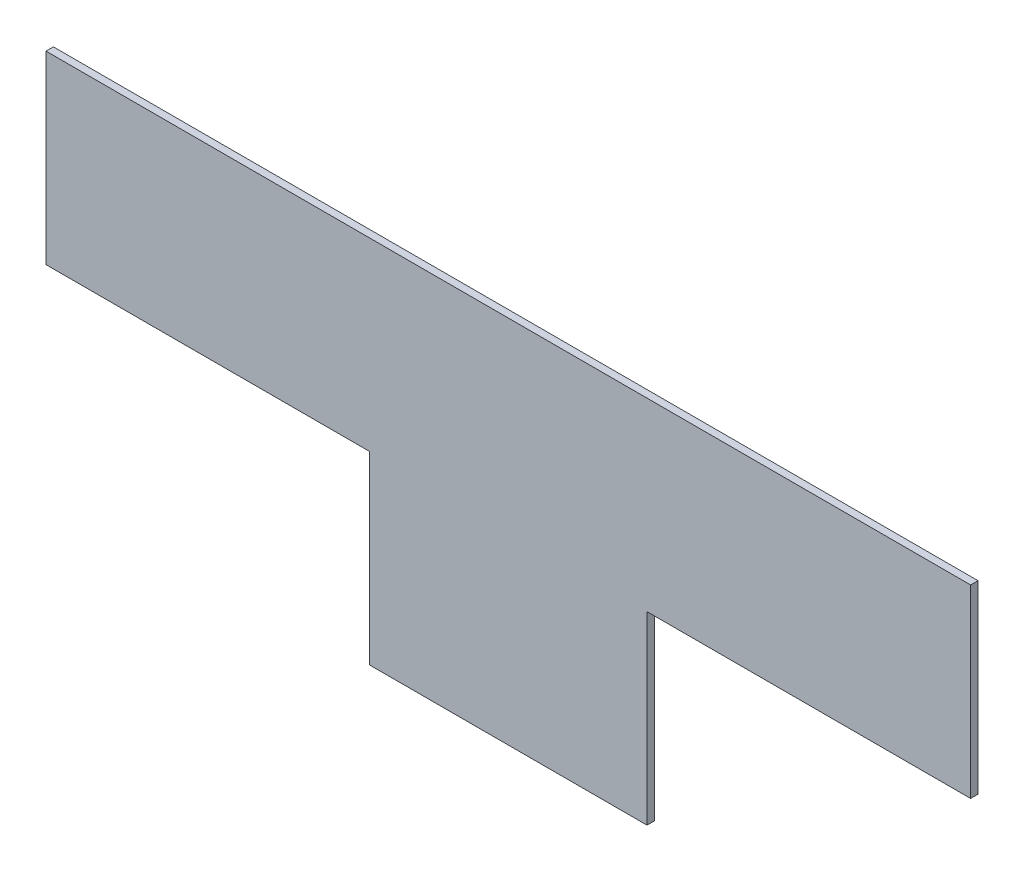
ISO-10303-21;
HEADER;
FILE_DESCRIPTION(('STEP AP214'),'2;1');
FILE_NAME('part.step','',(''),(''),'','','');
FILE_SCHEMA(('AUTOMOTIVE_DESIGN { 1 0 10303 214 1 1 1 1 }'));
ENDSEC;
DATA;
#1=APPLICATION_CONTEXT('core data for automotive mechanical design processes');
#2=APPLICATION_PROTOCOL_DEFINITION('international standard','automotive_design',2000,#1);
#3=PRODUCT_CONTEXT('',#1,'mechanical');
#4=PRODUCT('Part','Part','',(#3));
#5=PRODUCT_RELATED_PRODUCT_CATEGORY('part','',(#4));
#6=PRODUCT_DEFINITION_FORMATION('','',#4);
#7=PRODUCT_DEFINITION_CONTEXT('part definition',#1,'design');
#8=PRODUCT_DEFINITION('design','',#6,#7);
#9=PRODUCT_DEFINITION_SHAPE('','',#8);
#10=(LENGTH_UNIT() NAMED_UNIT(*) SI_UNIT(.MILLI.,.METRE.));
#11=(NAMED_UNIT(*) PLANE_ANGLE_UNIT() SI_UNIT($,.RADIAN.));
#12=(NAMED_UNIT(*) SI_UNIT($,.STERADIAN.) SOLID_ANGLE_UNIT());
#13=UNCERTAINTY_MEASURE_WITH_UNIT(LENGTH_MEASURE(1.E-05),#10,'distance_accuracy_value','');
#14=(GEOMETRIC_REPRESENTATION_CONTEXT(3) GLOBAL_UNCERTAINTY_ASSIGNED_CONTEXT((#13)) GLOBAL_UNIT_ASSIGNED_CONTEXT((#10,
#11,#12)) REPRESENTATION_CONTEXT('',''));
#15=CARTESIAN_POINT('',(0.,0.,0.));
#16=DIRECTION('',(0.,0.,1.));
#17=DIRECTION('',(1.,0.,0.));
#18=AXIS2_PLACEMENT_3D('',#15,#16,#17);
#19=CARTESIAN_POINT('',(-1000.,-400.,16.));
#20=DIRECTION('',(1.,0.,0.));
#21=DIRECTION('',(0.,0.,-1.));
#22=AXIS2_PLACEMENT_3D('',#19,#20,#21);
#23=PLANE('',#22);
#24=DIRECTION('',(0.,-1.,0.));
#25=VECTOR('',#24,1.);
#26=CARTESIAN_POINT('',(-1000.,-400.,0.));
#27=LINE('',#26,#25);
#28=CARTESIAN_POINT('',(-1000.,400.,0.));
#29=VERTEX_POINT('',#28);
#30=CARTESIAN_POINT('',(-1000.,-2.20740503228967E-13,0.));
#31=VERTEX_POINT('',#30);
#32=EDGE_CURVE('E137',#29,#31,#27,.T.);
#33=ORIENTED_EDGE('',*,*,#32,.T.);
#34=DIRECTION('',(0.,0.,1.));
#35=VECTOR('',#34,1.);
#36=CARTESIAN_POINT('',(-1000.,-2.22044604925031E-13,16.));
#37=LINE('',#36,#35);
#38=CARTESIAN_POINT('',(-1000.,-2.20740503228967E-13,16.));
#39=VERTEX_POINT('',#38);
#40=EDGE_CURVE('E135',#31,#39,#37,.T.);
#41=ORIENTED_EDGE('',*,*,#40,.T.);
#42=DIRECTION('',(0.,-1.,0.));
#43=VECTOR('',#42,1.);
#44=CARTESIAN_POINT('',(-1000.,-400.,16.));
#45=LINE('',#44,#43);
#46=CARTESIAN_POINT('',(-1000.,400.,16.));
#47=VERTEX_POINT('',#46);
#48=EDGE_CURVE('E119',#47,#39,#45,.T.);
#49=ORIENTED_EDGE('',*,*,#48,.F.);
#50=DIRECTION('',(0.,0.,-1.));
#51=VECTOR('',#50,1.);
#52=CARTESIAN_POINT('',(-1000.,400.,16.));
#53=LINE('',#52,#51);
#54=EDGE_CURVE('E146',#47,#29,#53,.T.);
#55=ORIENTED_EDGE('',*,*,#54,.T.);
#56=EDGE_LOOP('',(#33,#41,#49,#55));
#57=FACE_BOUND('',#56,.T.);
#58=ADVANCED_FACE('F35',(#57),#23,.F.);
#59=CARTESIAN_POINT('',(1000.,-400.,16.));
#60=DIRECTION('',(0.,1.,0.));
#61=DIRECTION('',(-1.,0.,0.));
#62=AXIS2_PLACEMENT_3D('',#59,#60,#61);
#63=PLANE('',#62);
#64=DIRECTION('',(1.,0.,0.));
#65=VECTOR('',#64,1.);
#66=CARTESIAN_POINT('',(1000.,-400.,16.));
#67=LINE('',#66,#65);
#68=CARTESIAN_POINT('',(-300.,-400.,16.));
#69=VERTEX_POINT('',#68);
#70=CARTESIAN_POINT('',(300.,-400.,16.));
#71=VERTEX_POINT('',#70);
#72=EDGE_CURVE('E139',#69,#71,#67,.T.);
#73=ORIENTED_EDGE('',*,*,#72,.F.);
#74=DIRECTION('',(0.,0.,-1.));
#75=VECTOR('',#74,1.);
#76=CARTESIAN_POINT('',(-300.,-400.,16.));
#77=LINE('',#76,#75);
#78=CARTESIAN_POINT('',(-300.,-400.,0.));
#79=VERTEX_POINT('',#78);
#80=EDGE_CURVE('E104',#69,#79,#77,.T.);
#81=ORIENTED_EDGE('',*,*,#80,.T.);
#82=DIRECTION('',(1.,0.,0.));
#83=VECTOR('',#82,1.);
#84=CARTESIAN_POINT('',(1000.,-400.,0.));
#85=LINE('',#84,#83);
#86=CARTESIAN_POINT('',(300.,-400.,0.));
#87=VERTEX_POINT('',#86);
#88=EDGE_CURVE('E149',#79,#87,#85,.T.);
#89=ORIENTED_EDGE('',*,*,#88,.T.);
#90=DIRECTION('',(0.,0.,1.));
#91=VECTOR('',#90,1.);
#92=CARTESIAN_POINT('',(300.,-400.,16.));
#93=LINE('',#92,#91);
#94=EDGE_CURVE('E131',#87,#71,#93,.T.);
#95=ORIENTED_EDGE('',*,*,#94,.T.);
#96=EDGE_LOOP('',(#73,#81,#89,#95));
#97=FACE_BOUND('',#96,.T.);
#98=ADVANCED_FACE('F177',(#97),#63,.F.);
#99=CARTESIAN_POINT('',(1000.,-400.,16.));
#100=DIRECTION('',(-1.,0.,0.));
#101=DIRECTION('',(0.,0.,1.));
#102=AXIS2_PLACEMENT_3D('',#99,#100,#101);
#103=PLANE('',#102);
#104=DIRECTION('',(0.,1.,0.));
#105=VECTOR('',#104,1.);
#106=CARTESIAN_POINT('',(1000.,-400.,16.));
#107=LINE('',#106,#105);
#108=CARTESIAN_POINT('',(1000.,-1.94802819260853E-13,16.));
#109=VERTEX_POINT('',#108);
#110=CARTESIAN_POINT('',(1000.,400.,16.));
#111=VERTEX_POINT('',#110);
#112=EDGE_CURVE('E142',#109,#111,#107,.T.);
#113=ORIENTED_EDGE('',*,*,#112,.F.);
#114=DIRECTION('',(0.,0.,-1.));
#115=VECTOR('',#114,1.);
#116=CARTESIAN_POINT('',(1000.,-1.66533453693773E-13,16.));
#117=LINE('',#116,#115);
#118=CARTESIAN_POINT('',(1000.,-1.94802819260853E-13,0.));
#119=VERTEX_POINT('',#118);
#120=EDGE_CURVE('E114',#109,#119,#117,.T.);
#121=ORIENTED_EDGE('',*,*,#120,.T.);
#122=DIRECTION('',(0.,1.,0.));
#123=VECTOR('',#122,1.);
#124=CARTESIAN_POINT('',(1000.,-400.,0.));
#125=LINE('',#124,#123);
#126=CARTESIAN_POINT('',(1000.,400.,0.));
#127=VERTEX_POINT('',#126);
#128=EDGE_CURVE('E152',#119,#127,#125,.T.);
#129=ORIENTED_EDGE('',*,*,#128,.T.);
#130=DIRECTION('',(0.,0.,-1.));
#131=VECTOR('',#130,1.);
#132=CARTESIAN_POINT('',(1000.,400.,16.));
#133=LINE('',#132,#131);
#134=EDGE_CURVE('E157',#111,#127,#133,.T.);
#135=ORIENTED_EDGE('',*,*,#134,.F.);
#136=EDGE_LOOP('',(#113,#121,#129,#135));
#137=FACE_BOUND('',#136,.T.);
#138=ADVANCED_FACE('F170',(#137),#103,.F.);
#139=CARTESIAN_POINT('',(1000.,400.,16.));
#140=DIRECTION('',(0.,-1.,0.));
#141=DIRECTION('',(1.,0.,0.));
#142=AXIS2_PLACEMENT_3D('',#139,#140,#141);
#143=PLANE('',#142);
#144=DIRECTION('',(-1.,0.,0.));
#145=VECTOR('',#144,1.);
#146=CARTESIAN_POINT('',(1000.,400.,0.));
#147=LINE('',#146,#145);
#148=EDGE_CURVE('E140',#127,#29,#147,.T.);
#149=ORIENTED_EDGE('',*,*,#148,.T.);
#150=ORIENTED_EDGE('',*,*,#54,.F.);
#151=DIRECTION('',(-1.,0.,0.));
#152=VECTOR('',#151,1.);
#153=CARTESIAN_POINT('',(1000.,400.,16.));
#154=LINE('',#153,#152);
#155=EDGE_CURVE('E144',#111,#47,#154,.T.);
#156=ORIENTED_EDGE('',*,*,#155,.F.);
#157=ORIENTED_EDGE('',*,*,#134,.T.);
#158=EDGE_LOOP('',(#149,#150,#156,#157));
#159=FACE_BOUND('',#158,.T.);
#160=ADVANCED_FACE('F181',(#159),#143,.F.);
#161=CARTESIAN_POINT('',(0.,0.,16.));
#162=DIRECTION('',(0.,0.,1.));
#163=DIRECTION('',(1.,0.,0.));
#164=AXIS2_PLACEMENT_3D('',#161,#162,#163);
#165=PLANE('',#164);
#166=DIRECTION('',(-1.,0.,0.));
#167=VECTOR('',#166,1.);
#168=CARTESIAN_POINT('',(-300.,-1.42040517710826E-13,16.));
#169=LINE('',#168,#167);
#170=CARTESIAN_POINT('',(-300.,-1.42040517710826E-13,16.));
#171=VERTEX_POINT('',#170);
#172=EDGE_CURVE('E109',#171,#39,#169,.T.);
#173=ORIENTED_EDGE('',*,*,#172,.F.);
#174=DIRECTION('',(0.,1.,0.));
#175=VECTOR('',#174,1.);
#176=CARTESIAN_POINT('',(-300.,-400.,16.));
#177=LINE('',#176,#175);
#178=EDGE_CURVE('E100',#69,#171,#177,.T.);
#179=ORIENTED_EDGE('',*,*,#178,.F.);
#180=ORIENTED_EDGE('',*,*,#72,.T.);
#181=DIRECTION('',(0.,-1.,0.));
#182=VECTOR('',#181,1.);
#183=CARTESIAN_POINT('',(300.,-457.580605905589,16.));
#184=LINE('',#183,#182);
#185=CARTESIAN_POINT('',(300.,0.,16.));
#186=VERTEX_POINT('',#185);
#187=EDGE_CURVE('E124',#186,#71,#184,.T.);
#188=ORIENTED_EDGE('',*,*,#187,.F.);
#189=DIRECTION('',(-1.,0.,0.));
#190=VECTOR('',#189,1.);
#191=CARTESIAN_POINT('',(300.,0.,16.));
#192=LINE('',#191,#190);
#193=EDGE_CURVE('E125',#109,#186,#192,.T.);
#194=ORIENTED_EDGE('',*,*,#193,.F.);
#195=ORIENTED_EDGE('',*,*,#112,.T.);
#196=ORIENTED_EDGE('',*,*,#155,.T.);
#197=ORIENTED_EDGE('',*,*,#48,.T.);
#198=EDGE_LOOP('',(#173,#179,#180,#188,#194,#195,#196,#197));
#199=FACE_BOUND('',#198,.T.);
#200=ADVANCED_FACE('F117',(#199),#165,.T.);
#201=CARTESIAN_POINT('',(0.,0.,0.));
#202=DIRECTION('',(0.,0.,1.));
#203=DIRECTION('',(1.,0.,0.));
#204=AXIS2_PLACEMENT_3D('',#201,#202,#203);
#205=PLANE('',#204);
#206=DIRECTION('',(0.,1.,0.));
#207=VECTOR('',#206,1.);
#208=CARTESIAN_POINT('',(-300.,0.,0.));
#209=LINE('',#208,#207);
#210=CARTESIAN_POINT('',(-300.,-1.4204051664207E-13,0.));
#211=VERTEX_POINT('',#210);
#212=EDGE_CURVE('E11',#79,#211,#209,.T.);
#213=ORIENTED_EDGE('',*,*,#212,.T.);
#214=DIRECTION('',(-1.,0.,0.));
#215=VECTOR('',#214,1.);
#216=CARTESIAN_POINT('',(-300.,-1.42040517710826E-13,0.));
#217=LINE('',#216,#215);
#218=EDGE_CURVE('E49',#211,#31,#217,.T.);
#219=ORIENTED_EDGE('',*,*,#218,.T.);
#220=ORIENTED_EDGE('',*,*,#32,.F.);
#221=ORIENTED_EDGE('',*,*,#148,.F.);
#222=ORIENTED_EDGE('',*,*,#128,.F.);
#223=DIRECTION('',(-1.,0.,0.));
#224=VECTOR('',#223,1.);
#225=CARTESIAN_POINT('',(0.,0.,0.));
#226=LINE('',#225,#224);
#227=CARTESIAN_POINT('',(300.,0.,0.));
#228=VERTEX_POINT('',#227);
#229=EDGE_CURVE('E42',#119,#228,#226,.T.);
#230=ORIENTED_EDGE('',*,*,#229,.T.);
#231=DIRECTION('',(0.,-1.,0.));
#232=VECTOR('',#231,1.);
#233=CARTESIAN_POINT('',(300.,-400.,0.));
#234=LINE('',#233,#232);
#235=EDGE_CURVE('E57',#228,#87,#234,.T.);
#236=ORIENTED_EDGE('',*,*,#235,.T.);
#237=ORIENTED_EDGE('',*,*,#88,.F.);
#238=EDGE_LOOP('',(#213,#219,#220,#221,#222,#230,#236,#237));
#239=FACE_BOUND('',#238,.T.);
#240=ADVANCED_FACE('F162',(#239),#205,.F.);
#241=CARTESIAN_POINT('',(300.,-457.580605905589,0.));
#242=DIRECTION('',(-1.,0.,0.));
#243=DIRECTION('',(0.,0.,1.));
#244=AXIS2_PLACEMENT_3D('',#241,#242,#243);
#245=PLANE('',#244);
#246=ORIENTED_EDGE('',*,*,#235,.F.);
#247=DIRECTION('',(0.,0.,1.));
#248=VECTOR('',#247,1.);
#249=CARTESIAN_POINT('',(300.,0.,0.));
#250=LINE('',#249,#248);
#251=EDGE_CURVE('E110',#228,#186,#250,.T.);
#252=ORIENTED_EDGE('',*,*,#251,.T.);
#253=ORIENTED_EDGE('',*,*,#187,.T.);
#254=ORIENTED_EDGE('',*,*,#94,.F.);
#255=EDGE_LOOP('',(#246,#252,#253,#254));
#256=FACE_BOUND('',#255,.T.);
#257=ADVANCED_FACE('F175',(#256),#245,.F.);
#258=CARTESIAN_POINT('',(300.,0.,0.));
#259=DIRECTION('',(0.,1.,0.));
#260=DIRECTION('',(-1.,0.,0.));
#261=AXIS2_PLACEMENT_3D('',#258,#259,#260);
#262=PLANE('',#261);
#263=ORIENTED_EDGE('',*,*,#193,.T.);
#264=ORIENTED_EDGE('',*,*,#251,.F.);
#265=ORIENTED_EDGE('',*,*,#229,.F.);
#266=ORIENTED_EDGE('',*,*,#120,.F.);
#267=EDGE_LOOP('',(#263,#264,#265,#266));
#268=FACE_BOUND('',#267,.T.);
#269=ADVANCED_FACE('F166',(#268),#262,.F.);
#270=CARTESIAN_POINT('',(-300.,-1.42040517710826E-13,0.));
#271=DIRECTION('',(0.,1.,0.));
#272=DIRECTION('',(-1.,0.,0.));
#273=AXIS2_PLACEMENT_3D('',#270,#271,#272);
#274=PLANE('',#273);
#275=ORIENTED_EDGE('',*,*,#218,.F.);
#276=DIRECTION('',(0.,0.,1.));
#277=VECTOR('',#276,1.);
#278=CARTESIAN_POINT('',(-300.,-1.42040517710826E-13,0.));
#279=LINE('',#278,#277);
#280=EDGE_CURVE('E102',#211,#171,#279,.T.);
#281=ORIENTED_EDGE('',*,*,#280,.T.);
#282=ORIENTED_EDGE('',*,*,#172,.T.);
#283=ORIENTED_EDGE('',*,*,#40,.F.);
#284=EDGE_LOOP('',(#275,#281,#282,#283));
#285=FACE_BOUND('',#284,.T.);
#286=ADVANCED_FACE('F112',(#285),#274,.F.);
#287=CARTESIAN_POINT('',(-300.,-400.,0.));
#288=DIRECTION('',(1.,0.,0.));
#289=DIRECTION('',(0.,1.,0.));
#290=AXIS2_PLACEMENT_3D('',#287,#288,#289);
#291=PLANE('',#290);
#292=ORIENTED_EDGE('',*,*,#178,.T.);
#293=ORIENTED_EDGE('',*,*,#280,.F.);
#294=ORIENTED_EDGE('',*,*,#212,.F.);
#295=ORIENTED_EDGE('',*,*,#80,.F.);
#296=EDGE_LOOP('',(#292,#293,#294,#295));
#297=FACE_BOUND('',#296,.T.);
#298=ADVANCED_FACE('F101',(#297),#291,.F.);
#299=CLOSED_SHELL('',(#58,#98,#138,#160,#200,#240,#257,#269,#286,#298));
#300=MANIFOLD_SOLID_BREP('B2',#299);
#301=ADVANCED_BREP_SHAPE_REPRESENTATION('',(#18,#300),#14);
#302=SHAPE_DEFINITION_REPRESENTATION(#9,#301);
ENDSEC;
END-ISO-10303-21;
